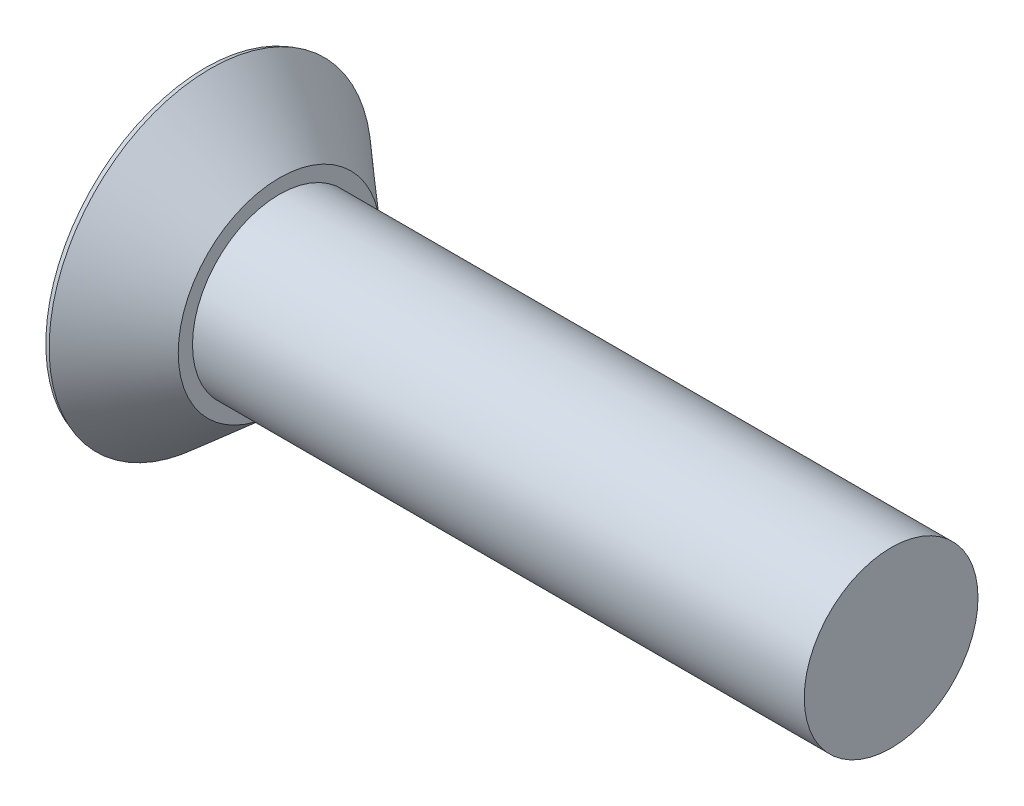
ISO-10303-21;
HEADER;
FILE_DESCRIPTION(('STEP AP214'),'2;1');
FILE_NAME('part.step','',(''),(''),'','','');
FILE_SCHEMA(('AUTOMOTIVE_DESIGN { 1 0 10303 214 1 1 1 1 }'));
ENDSEC;
DATA;
#1=APPLICATION_CONTEXT('core data for automotive mechanical design processes');
#2=APPLICATION_PROTOCOL_DEFINITION('international standard','automotive_design',2000,#1);
#3=PRODUCT_CONTEXT('',#1,'mechanical');
#4=PRODUCT('Part','Part','',(#3));
#5=PRODUCT_RELATED_PRODUCT_CATEGORY('part','',(#4));
#6=PRODUCT_DEFINITION_FORMATION('','',#4);
#7=PRODUCT_DEFINITION_CONTEXT('part definition',#1,'design');
#8=PRODUCT_DEFINITION('design','',#6,#7);
#9=PRODUCT_DEFINITION_SHAPE('','',#8);
#10=(LENGTH_UNIT() NAMED_UNIT(*) SI_UNIT(.MILLI.,.METRE.));
#11=(NAMED_UNIT(*) PLANE_ANGLE_UNIT() SI_UNIT($,.RADIAN.));
#12=(NAMED_UNIT(*) SI_UNIT($,.STERADIAN.) SOLID_ANGLE_UNIT());
#13=UNCERTAINTY_MEASURE_WITH_UNIT(LENGTH_MEASURE(1.E-05),#10,'distance_accuracy_value','');
#14=(GEOMETRIC_REPRESENTATION_CONTEXT(3) GLOBAL_UNCERTAINTY_ASSIGNED_CONTEXT((#13)) GLOBAL_UNIT_ASSIGNED_CONTEXT((#10,
#11,#12)) REPRESENTATION_CONTEXT('',''));
#15=CARTESIAN_POINT('',(0.,0.,0.));
#16=DIRECTION('',(0.,0.,1.));
#17=DIRECTION('',(1.,0.,0.));
#18=AXIS2_PLACEMENT_3D('',#15,#16,#17);
#19=CARTESIAN_POINT('',(-9.525,0.,0.));
#20=DIRECTION('',(1.,0.,0.));
#21=DIRECTION('',(0.,1.,0.));
#22=AXIS2_PLACEMENT_3D('',#19,#20,#21);
#23=PLANE('',#22);
#24=CARTESIAN_POINT('',(-9.525,0.,0.));
#25=DIRECTION('',(1.,0.,0.));
#26=DIRECTION('',(0.,1.,0.));
#27=AXIS2_PLACEMENT_3D('',#24,#25,#26);
#28=CIRCLE('',#27,4.42896480288777);
#29=CARTESIAN_POINT('',(-9.525,4.42896480288777,0.));
#30=VERTEX_POINT('',#29);
#31=EDGE_CURVE('E45',#30,#30,#28,.F.);
#32=ORIENTED_EDGE('',*,*,#31,.T.);
#33=EDGE_LOOP('',(#32));
#34=FACE_BOUND('',#33,.T.);
#35=CARTESIAN_POINT('',(-9.525,0.,0.));
#36=DIRECTION('',(-1.,0.,0.));
#37=DIRECTION('',(0.,-1.,0.));
#38=AXIS2_PLACEMENT_3D('',#35,#36,#37);
#39=CIRCLE('',#38,2.56686175479273);
#40=CARTESIAN_POINT('',(-9.525,0.612986666666666,2.49259435422343));
#41=VERTEX_POINT('',#40);
#42=CARTESIAN_POINT('',(-9.525,-0.612986666666676,2.49259435422343));
#43=VERTEX_POINT('',#42);
#44=EDGE_CURVE('E233',#41,#43,#39,.F.);
#45=ORIENTED_EDGE('',*,*,#44,.T.);
#46=DIRECTION('',(0.,0.,1.));
#47=VECTOR('',#46,1.);
#48=CARTESIAN_POINT('',(-9.525,-0.612986666666678,3.0030091049257));
#49=LINE('',#48,#47);
#50=CARTESIAN_POINT('',(-9.525,-0.612986666666674,1.80799788579618));
#51=VERTEX_POINT('',#50);
#52=EDGE_CURVE('E209',#51,#43,#49,.T.);
#53=ORIENTED_EDGE('',*,*,#52,.F.);
#54=DIRECTION('',(0.,0.382683432365087,0.923879532511288));
#55=VECTOR('',#54,1.);
#56=CARTESIAN_POINT('',(-9.525,-0.612986666666674,1.80799788579618));
#57=LINE('',#56,#55);
#58=CARTESIAN_POINT('',(-9.525,-0.962997349155703,0.962997349155698));
#59=VERTEX_POINT('',#58);
#60=EDGE_CURVE('E205',#59,#51,#57,.T.);
#61=ORIENTED_EDGE('',*,*,#60,.F.);
#62=DIRECTION('',(0.,0.923879532511285,0.382683432365093));
#63=VECTOR('',#62,1.);
#64=CARTESIAN_POINT('',(-9.525,-0.962997349155703,0.962997349155698));
#65=LINE('',#64,#63);
#66=CARTESIAN_POINT('',(-9.525,-1.80799788579619,0.612986666666661));
#67=VERTEX_POINT('',#66);
#68=EDGE_CURVE('E215',#67,#59,#65,.T.);
#69=ORIENTED_EDGE('',*,*,#68,.F.);
#70=DIRECTION('',(0.,1.,0.));
#71=VECTOR('',#70,1.);
#72=CARTESIAN_POINT('',(-9.525,-1.80799788579619,0.612986666666661));
#73=LINE('',#72,#71);
#74=CARTESIAN_POINT('',(-9.525,-2.49259435422343,0.612986666666659));
#75=VERTEX_POINT('',#74);
#76=EDGE_CURVE('E212',#75,#67,#73,.T.);
#77=ORIENTED_EDGE('',*,*,#76,.F.);
#78=CARTESIAN_POINT('',(-9.525,0.,0.));
#79=DIRECTION('',(-1.,0.,0.));
#80=DIRECTION('',(0.,-1.,0.));
#81=AXIS2_PLACEMENT_3D('',#78,#79,#80);
#82=CIRCLE('',#81,2.56686175479273);
#83=CARTESIAN_POINT('',(-9.525,-2.49259435422343,-0.612986666666665));
#84=VERTEX_POINT('',#83);
#85=EDGE_CURVE('E219',#75,#84,#82,.F.);
#86=ORIENTED_EDGE('',*,*,#85,.T.);
#87=DIRECTION('',(0.,-1.,0.));
#88=VECTOR('',#87,1.);
#89=CARTESIAN_POINT('',(-9.525,-3.0030091049257,-0.612986666666665));
#90=LINE('',#89,#88);
#91=CARTESIAN_POINT('',(-9.525,-1.80799788579619,-0.612986666666666));
#92=VERTEX_POINT('',#91);
#93=EDGE_CURVE('E193',#92,#84,#90,.T.);
#94=ORIENTED_EDGE('',*,*,#93,.F.);
#95=DIRECTION('',(0.,-0.923879532511287,0.38268343236509));
#96=VECTOR('',#95,1.);
#97=CARTESIAN_POINT('',(-9.525,-1.80799788579619,-0.612986666666666));
#98=LINE('',#97,#96);
#99=CARTESIAN_POINT('',(-9.525,-0.962997349155703,-0.962997349155697));
#100=VERTEX_POINT('',#99);
#101=EDGE_CURVE('E190',#100,#92,#98,.T.);
#102=ORIENTED_EDGE('',*,*,#101,.F.);
#103=DIRECTION('',(0.,-0.38268343236509,0.923879532511287));
#104=VECTOR('',#103,1.);
#105=CARTESIAN_POINT('',(-9.525,-0.962997349155703,-0.962997349155697));
#106=LINE('',#105,#104);
#107=CARTESIAN_POINT('',(-9.525,-0.612986666666669,-1.80799788579618));
#108=VERTEX_POINT('',#107);
#109=EDGE_CURVE('E200',#108,#100,#106,.T.);
#110=ORIENTED_EDGE('',*,*,#109,.F.);
#111=DIRECTION('',(0.,0.,1.));
#112=VECTOR('',#111,1.);
#113=CARTESIAN_POINT('',(-9.525,-0.612986666666669,-1.80799788579618));
#114=LINE('',#113,#112);
#115=CARTESIAN_POINT('',(-9.525,-0.612986666666669,-2.49259435422343));
#116=VERTEX_POINT('',#115);
#117=EDGE_CURVE('E197',#116,#108,#114,.T.);
#118=ORIENTED_EDGE('',*,*,#117,.F.);
#119=CARTESIAN_POINT('',(-9.525,0.,0.));
#120=DIRECTION('',(-1.,0.,0.));
#121=DIRECTION('',(0.,-1.,0.));
#122=AXIS2_PLACEMENT_3D('',#119,#120,#121);
#123=CIRCLE('',#122,2.56686175479273);
#124=CARTESIAN_POINT('',(-9.525,0.61298666666669,-2.49259435422342));
#125=VERTEX_POINT('',#124);
#126=EDGE_CURVE('E183',#116,#125,#123,.F.);
#127=ORIENTED_EDGE('',*,*,#126,.T.);
#128=DIRECTION('',(0.,0.,-1.));
#129=VECTOR('',#128,1.);
#130=CARTESIAN_POINT('',(-9.525,0.612986666666695,-3.0030091049257));
#131=LINE('',#130,#129);
#132=CARTESIAN_POINT('',(-9.525,0.612986666666683,-1.80799788579618));
#133=VERTEX_POINT('',#132);
#134=EDGE_CURVE('E164',#133,#125,#131,.T.);
#135=ORIENTED_EDGE('',*,*,#134,.F.);
#136=DIRECTION('',(0.,-0.38268343236508,-0.923879532511291));
#137=VECTOR('',#136,1.);
#138=CARTESIAN_POINT('',(-9.525,0.612986666666683,-1.80799788579618));
#139=LINE('',#138,#137);
#140=CARTESIAN_POINT('',(-9.525,0.962997349155706,-0.962997349155691));
#141=VERTEX_POINT('',#140);
#142=EDGE_CURVE('E173',#141,#133,#139,.T.);
#143=ORIENTED_EDGE('',*,*,#142,.F.);
#144=DIRECTION('',(0.,-0.923879532511283,-0.3826834323651));
#145=VECTOR('',#144,1.);
#146=CARTESIAN_POINT('',(-9.525,0.962997349155706,-0.962997349155691));
#147=LINE('',#146,#145);
#148=CARTESIAN_POINT('',(-9.525,1.80799788579619,-0.612986666666649));
#149=VERTEX_POINT('',#148);
#150=EDGE_CURVE('E170',#149,#141,#147,.T.);
#151=ORIENTED_EDGE('',*,*,#150,.F.);
#152=DIRECTION('',(0.,-1.,0.));
#153=VECTOR('',#152,1.);
#154=CARTESIAN_POINT('',(-9.525,1.80799788579619,-0.612986666666649));
#155=LINE('',#154,#153);
#156=CARTESIAN_POINT('',(-9.525,2.49259435422343,-0.612986666666642));
#157=VERTEX_POINT('',#156);
#158=EDGE_CURVE('E184',#157,#149,#155,.T.);
#159=ORIENTED_EDGE('',*,*,#158,.F.);
#160=CARTESIAN_POINT('',(-9.525,2.49259435422343,0.612986666666665));
#161=VERTEX_POINT('',#160);
#162=EDGE_CURVE('E236',#157,#161,#39,.F.);
#163=ORIENTED_EDGE('',*,*,#162,.T.);
#164=DIRECTION('',(0.,1.,0.));
#165=VECTOR('',#164,1.);
#166=CARTESIAN_POINT('',(-9.525,3.0030091049257,0.612986666666665));
#167=LINE('',#166,#165);
#168=CARTESIAN_POINT('',(-9.525,1.80799788579618,0.612986666666666));
#169=VERTEX_POINT('',#168);
#170=EDGE_CURVE('E53',#169,#161,#167,.T.);
#171=ORIENTED_EDGE('',*,*,#170,.F.);
#172=DIRECTION('',(0.,0.923879532511287,-0.38268343236509));
#173=VECTOR('',#172,1.);
#174=CARTESIAN_POINT('',(-9.525,1.80799788579618,0.612986666666666));
#175=LINE('',#174,#173);
#176=CARTESIAN_POINT('',(-9.525,0.962997349155699,0.962997349155697));
#177=VERTEX_POINT('',#176);
#178=EDGE_CURVE('E222',#177,#169,#175,.T.);
#179=ORIENTED_EDGE('',*,*,#178,.F.);
#180=DIRECTION('',(0.,0.38268343236509,-0.923879532511287));
#181=VECTOR('',#180,1.);
#182=CARTESIAN_POINT('',(-9.525,0.962997349155699,0.962997349155697));
#183=LINE('',#182,#181);
#184=CARTESIAN_POINT('',(-9.525,0.612986666666666,1.80799788579618));
#185=VERTEX_POINT('',#184);
#186=EDGE_CURVE('E229',#185,#177,#183,.T.);
#187=ORIENTED_EDGE('',*,*,#186,.F.);
#188=DIRECTION('',(0.,0.,-1.));
#189=VECTOR('',#188,1.);
#190=CARTESIAN_POINT('',(-9.525,0.612986666666666,1.80799788579618));
#191=LINE('',#190,#189);
#192=EDGE_CURVE('E227',#41,#185,#191,.T.);
#193=ORIENTED_EDGE('',*,*,#192,.F.);
#194=EDGE_LOOP('',(#45,#53,#61,#69,#77,#86,#94,#102,#110,#118,#127,#135,#143,#151,#159,#163,
#171,#179,#187,#193));
#195=FACE_BOUND('',#194,.T.);
#196=ADVANCED_FACE('F36',(#34,#195),#23,.F.);
#197=CARTESIAN_POINT('',(9.525,0.,0.));
#198=DIRECTION('',(-1.,0.,0.));
#199=DIRECTION('',(0.,-1.,0.));
#200=AXIS2_PLACEMENT_3D('',#197,#198,#199);
#201=PLANE('',#200);
#202=CARTESIAN_POINT('',(9.525,0.,0.));
#203=DIRECTION('',(-1.,0.,0.));
#204=DIRECTION('',(0.,-1.,0.));
#205=AXIS2_PLACEMENT_3D('',#202,#203,#204);
#206=CIRCLE('',#205,2.413);
#207=CARTESIAN_POINT('',(9.525,-2.41299999999999,0.));
#208=VERTEX_POINT('',#207);
#209=EDGE_CURVE('E242',#208,#208,#206,.T.);
#210=ORIENTED_EDGE('',*,*,#209,.F.);
#211=EDGE_LOOP('',(#210));
#212=FACE_BOUND('',#211,.T.);
#213=ADVANCED_FACE('F394',(#212),#201,.F.);
#214=CARTESIAN_POINT('',(-9.525,0.,0.));
#215=DIRECTION('',(-1.,0.,0.));
#216=DIRECTION('',(0.,-1.,0.));
#217=AXIS2_PLACEMENT_3D('',#214,#215,#216);
#218=CYLINDRICAL_SURFACE('',#217,2.413);
#219=CARTESIAN_POINT('',(-7.4676,0.,0.));
#220=DIRECTION('',(-1.,0.,0.));
#221=DIRECTION('',(0.,-1.,0.));
#222=AXIS2_PLACEMENT_3D('',#219,#220,#221);
#223=CIRCLE('',#222,2.413);
#224=CARTESIAN_POINT('',(-7.4676,-2.413,0.));
#225=VERTEX_POINT('',#224);
#226=EDGE_CURVE('E239',#225,#225,#223,.T.);
#227=ORIENTED_EDGE('',*,*,#226,.F.);
#228=EDGE_LOOP('',(#227));
#229=FACE_BOUND('',#228,.T.);
#230=ORIENTED_EDGE('',*,*,#209,.T.);
#231=EDGE_LOOP('',(#230));
#232=FACE_BOUND('',#231,.T.);
#233=ADVANCED_FACE('F399',(#229,#232),#218,.T.);
#234=CARTESIAN_POINT('',(-7.4676,2.413,0.));
#235=DIRECTION('',(-1.,0.,0.));
#236=DIRECTION('',(0.,-1.,0.));
#237=AXIS2_PLACEMENT_3D('',#234,#235,#236);
#238=PLANE('',#237);
#239=CARTESIAN_POINT('',(-7.4676,0.,0.));
#240=DIRECTION('',(-1.,0.,0.));
#241=DIRECTION('',(0.,-1.,0.));
#242=AXIS2_PLACEMENT_3D('',#239,#240,#241);
#243=CIRCLE('',#242,2.80892946561688);
#244=CARTESIAN_POINT('',(-7.4676,-2.80892946561688,0.));
#245=VERTEX_POINT('',#244);
#246=EDGE_CURVE('E235',#245,#245,#243,.T.);
#247=ORIENTED_EDGE('',*,*,#246,.F.);
#248=EDGE_LOOP('',(#247));
#249=FACE_BOUND('',#248,.T.);
#250=ORIENTED_EDGE('',*,*,#226,.T.);
#251=EDGE_LOOP('',(#250));
#252=FACE_BOUND('',#251,.T.);
#253=ADVANCED_FACE('F405',(#249,#252),#238,.F.);
#254=CARTESIAN_POINT('',(-7.4676,0.,0.));
#255=DIRECTION('',(-1.,0.,0.));
#256=DIRECTION('',(0.,-1.,0.));
#257=AXIS2_PLACEMENT_3D('',#254,#255,#256);
#258=CONICAL_SURFACE('',#257,2.80892946561688,0.715584993317677);
#259=CARTESIAN_POINT('',(-9.38621192703535,0.,0.));
#260=DIRECTION('',(1.,0.,0.));
#261=DIRECTION('',(0.,1.,0.));
#262=AXIS2_PLACEMENT_3D('',#259,#260,#261);
#263=CIRCLE('',#262,4.47675336880476);
#264=CARTESIAN_POINT('',(-9.38621192703535,4.47675336880476,0.));
#265=VERTEX_POINT('',#264);
#266=EDGE_CURVE('E12',#265,#265,#263,.T.);
#267=ORIENTED_EDGE('',*,*,#266,.T.);
#268=EDGE_LOOP('',(#267));
#269=FACE_BOUND('',#268,.T.);
#270=ORIENTED_EDGE('',*,*,#246,.T.);
#271=EDGE_LOOP('',(#270));
#272=FACE_BOUND('',#271,.T.);
#273=ADVANCED_FACE('F270',(#269,#272),#258,.T.);
#274=CARTESIAN_POINT('',(-9.525,3.0030091049257,0.612986666666665));
#275=DIRECTION('',(-0.0871557427476584,0.,-0.996194698091746));
#276=DIRECTION('',(-0.996194698091746,0.,0.0871557427476584));
#277=AXIS2_PLACEMENT_3D('',#274,#275,#276);
#278=PLANE('',#277);
#279=CARTESIAN_POINT('',(-9.525,2.49259435422343,0.612986666666665));
#280=CARTESIAN_POINT('',(-9.45852625718821,2.43451712174877,0.607170967748496));
#281=CARTESIAN_POINT('',(-9.39207159555621,2.37641786243142,0.601356938217244));
#282=CARTESIAN_POINT('',(-9.25921246540809,2.26016171559922,0.589733270483369));
#283=CARTESIAN_POINT('',(-9.19280799682935,2.20200482815647,0.583923632275266));
#284=CARTESIAN_POINT('',(-9.06006108173407,2.08561967425411,0.572309782086391));
#285=CARTESIAN_POINT('',(-8.99371863525081,2.02739140775625,0.56650557010853));
#286=CARTESIAN_POINT('',(-8.86111534464012,1.91084116370602,0.554904285433861));
#287=CARTESIAN_POINT('',(-8.7948545006156,1.85251918603572,0.549107212746055));
#288=CARTESIAN_POINT('',(-8.72864431374507,1.79413924450273,0.543314571984952));
#289=B_SPLINE_CURVE_WITH_KNOTS('',3,(#279,#280,#281,#282,#283,#284,#285,#286,#287,#288),
.UNSPECIFIED.,.F.,.F.,(4,2,2,2,4),(0.,0.265386357789265,0.530772383889083,0.796158552282147,
1.06154505496734),.UNSPECIFIED.);
#290=CARTESIAN_POINT('',(-8.72864431374506,1.79413924450274,0.54331457198495));
#291=VERTEX_POINT('',#290);
#292=EDGE_CURVE('E103',#161,#291,#289,.T.);
#293=ORIENTED_EDGE('',*,*,#292,.T.);
#294=DIRECTION('',(-0.996045029063886,0.0173337504938601,0.0871426484044397));
#295=VECTOR('',#294,1.);
#296=CARTESIAN_POINT('',(-9.54563210293773,1.80835693755996,0.614791741778417));
#297=LINE('',#296,#295);
#298=EDGE_CURVE('E232',#291,#169,#297,.T.);
#299=ORIENTED_EDGE('',*,*,#298,.T.);
#300=ORIENTED_EDGE('',*,*,#170,.T.);
#301=EDGE_LOOP('',(#293,#299,#300));
#302=FACE_BOUND('',#301,.T.);
#303=ADVANCED_FACE('F412',(#302),#278,.T.);
#304=CARTESIAN_POINT('',(-9.525,0.612986666666666,1.80799788579618));
#305=DIRECTION('',(-0.0871557427476582,-0.996194698091746,0.));
#306=DIRECTION('',(0.996194698091746,-0.0871557427476582,0.));
#307=AXIS2_PLACEMENT_3D('',#304,#305,#306);
#308=PLANE('',#307);
#309=CARTESIAN_POINT('',(-8.72864431374506,0.543314571984951,1.79413924450274));
#310=CARTESIAN_POINT('',(-8.79485450061559,0.549107212746055,1.85251918603572));
#311=CARTESIAN_POINT('',(-8.86111534464012,0.554904285433861,1.91084116370602));
#312=CARTESIAN_POINT('',(-8.99371863525081,0.56650557010853,2.02739140775624));
#313=CARTESIAN_POINT('',(-9.06006108173407,0.572309782086391,2.08561967425411));
#314=CARTESIAN_POINT('',(-9.19280799682935,0.583923632275266,2.20200482815647));
#315=CARTESIAN_POINT('',(-9.25921246540809,0.589733270483369,2.26016171559922));
#316=CARTESIAN_POINT('',(-9.3920715955562,0.601356938217245,2.37641786243142));
#317=CARTESIAN_POINT('',(-9.45852625718821,0.607170967748497,2.43451712174877));
#318=CARTESIAN_POINT('',(-9.525,0.612986666666666,2.49259435422343));
#319=B_SPLINE_CURVE_WITH_KNOTS('',3,(#309,#310,#311,#312,#313,#314,#315,#316,#317,#318),
.UNSPECIFIED.,.F.,.F.,(4,2,2,2,4),(0.,0.265386502685197,0.530772671078261,0.796158697178077,
1.06154505496734),.UNSPECIFIED.);
#320=CARTESIAN_POINT('',(-8.72864431374506,0.543314571984951,1.79413924450274));
#321=VERTEX_POINT('',#320);
#322=EDGE_CURVE('E110',#321,#41,#319,.T.);
#323=ORIENTED_EDGE('',*,*,#322,.T.);
#324=ORIENTED_EDGE('',*,*,#192,.T.);
#325=DIRECTION('',(-0.996045029063886,0.0871426484044395,0.0173337504938603));
#326=VECTOR('',#325,1.);
#327=CARTESIAN_POINT('',(-9.54079112793824,0.61436821134555,1.8082726921189));
#328=LINE('',#327,#326);
#329=EDGE_CURVE('E491',#321,#185,#328,.T.);
#330=ORIENTED_EDGE('',*,*,#329,.F.);
#331=EDGE_LOOP('',(#323,#324,#330));
#332=FACE_BOUND('',#331,.T.);
#333=ADVANCED_FACE('F386',(#332),#308,.T.);
#334=CARTESIAN_POINT('',(-9.525,0.962997349155699,0.962997349155697));
#335=DIRECTION('',(-0.0871557427476582,-0.920363891963224,-0.381227206369654));
#336=DIRECTION('',(0.,0.38268343236509,-0.923879532511287));
#337=AXIS2_PLACEMENT_3D('',#334,#335,#336);
#338=PLANE('',#337);
#339=CARTESIAN_POINT('',(-7.96936627882286,0.858830677621024,0.858830677621022));
#340=CARTESIAN_POINT('',(-7.98773008078839,0.845861311740582,0.894339808742347));
#341=CARTESIAN_POINT('',(-8.00751073815191,0.833290385156989,0.929210942225205));
#342=CARTESIAN_POINT('',(-8.04929523569009,0.808844137216208,0.997782131217437));
#343=CARTESIAN_POINT('',(-8.07129592703071,0.796967867344013,1.03148375676164));
#344=CARTESIAN_POINT('',(-8.11688394623063,0.773814996497049,1.09780201415296));
#345=CARTESIAN_POINT('',(-8.14046539553529,0.762536425620263,1.13042205781558));
#346=CARTESIAN_POINT('',(-8.18892091570705,0.740432754908314,1.19486288691552));
#347=CARTESIAN_POINT('',(-8.21379549823537,0.72960783768,1.22668334847634));
#348=CARTESIAN_POINT('',(-8.2896099953659,0.697817552188115,1.32076451343813));
#349=CARTESIAN_POINT('',(-8.3420138614753,0.677403712753784,1.38202839543574));
#350=CARTESIAN_POINT('',(-8.44933961567024,0.637580711010604,1.50270632169112));
#351=CARTESIAN_POINT('',(-8.50426350574405,0.618172374507332,1.56211882997023));
#352=CARTESIAN_POINT('',(-8.58774054968342,0.589669195208701,1.6500160215653));
#353=CARTESIAN_POINT('',(-8.61565663760378,0.580298841705688,1.6790202012557));
#354=CARTESIAN_POINT('',(-8.67188075716315,0.561701795703918,1.73677133803157));
#355=CARTESIAN_POINT('',(-8.70018925604009,0.552475308378392,1.76551790660447));
#356=CARTESIAN_POINT('',(-8.72864431374507,0.543314571984955,1.79413924450274));
#357=B_SPLINE_CURVE_WITH_KNOTS('',3,(#339,#340,#341,#342,#343,#344,#345,#346,#347,#348,#349,
#350,#351,#352,#353,#354,#355,#356),.UNSPECIFIED.,.F.,.F.,(4,2,2,2,2,2,2,2,4),(0.,
0.125991063230867,0.251805871235963,0.377176294454523,0.502596706949742,0.751972793926603,
1.00155054476538,1.12554483820984,1.24970222508254),.UNSPECIFIED.);
#358=CARTESIAN_POINT('',(-7.96936627882286,0.858830677621024,0.858830677621022));
#359=VERTEX_POINT('',#358);
#360=EDGE_CURVE('E373',#359,#321,#357,.T.);
#361=ORIENTED_EDGE('',*,*,#360,.T.);
#362=ORIENTED_EDGE('',*,*,#329,.T.);
#363=ORIENTED_EDGE('',*,*,#186,.T.);
#364=DIRECTION('',(-0.995546167269401,0.0666626913468322,0.0666626913468324));
#365=VECTOR('',#364,1.);
#366=CARTESIAN_POINT('',(-9.55785039116353,0.96519704170513,0.965197041705128));
#367=LINE('',#366,#365);
#368=EDGE_CURVE('E492',#359,#177,#367,.T.);
#369=ORIENTED_EDGE('',*,*,#368,.F.);
#370=EDGE_LOOP('',(#361,#362,#363,#369));
#371=FACE_BOUND('',#370,.T.);
#372=ADVANCED_FACE('F383',(#371),#338,.T.);
#373=CARTESIAN_POINT('',(-9.525,1.80799788579618,0.612986666666666));
#374=DIRECTION('',(-0.0871557427476583,-0.381227206369654,-0.920363891963224));
#375=DIRECTION('',(0.,0.923879532511287,-0.38268343236509));
#376=AXIS2_PLACEMENT_3D('',#373,#374,#375);
#377=PLANE('',#376);
#378=CARTESIAN_POINT('',(-8.72864431374506,1.79413924450274,0.54331457198495));
#379=CARTESIAN_POINT('',(-8.6928237231468,1.75810862754568,0.554846838037268));
#380=CARTESIAN_POINT('',(-8.65723649577501,1.72188224176137,0.566482293001348));
#381=CARTESIAN_POINT('',(-8.58665424443517,1.64894213550245,0.59001114348121));
#382=CARTESIAN_POINT('',(-8.55165920532459,1.61222842753187,0.601904532383704));
#383=CARTESIAN_POINT('',(-8.44808495847438,1.50157003185814,0.637932565338746));
#384=CARTESIAN_POINT('',(-8.38056559969842,1.4267592524772,0.662526320877639));
#385=CARTESIAN_POINT('',(-8.28277756568872,1.31178739021939,0.700888987462048));
#386=CARTESIAN_POINT('',(-8.2507060200217,1.27292798292597,0.713948000320908));
#387=CARTESIAN_POINT('',(-8.18823184537844,1.19412613928344,0.740672672844265));
#388=CARTESIAN_POINT('',(-8.15782823814341,1.15418435874481,0.754337968224948));
#389=CARTESIAN_POINT('',(-8.09910671946202,1.07273267855995,0.782515604420261));
#390=CARTESIAN_POINT('',(-8.07079969287983,1.03121608627811,0.797031748179821));
#391=CARTESIAN_POINT('',(-8.01739578555224,0.946411001554988,0.82710197210738));
#392=CARTESIAN_POINT('',(-7.99230571700901,0.903118997109708,0.842658152090496));
#393=CARTESIAN_POINT('',(-7.96936627882206,0.858830677621697,0.858830677620669));
#394=B_SPLINE_CURVE_WITH_KNOTS('',3,(#378,#379,#380,#381,#382,#383,#384,#385,#386,#387,#388,
#389,#390,#391,#392,#393),.UNSPECIFIED.,.F.,.F.,(4,2,2,2,2,2,2,4),(0.,0.156290436692992,
0.312576870908878,0.623628612554109,0.779746534885239,0.93577189181782,1.09255751450351,
1.24966984635691),.UNSPECIFIED.);
#395=EDGE_CURVE('E100',#291,#359,#394,.T.);
#396=ORIENTED_EDGE('',*,*,#395,.T.);
#397=ORIENTED_EDGE('',*,*,#368,.T.);
#398=ORIENTED_EDGE('',*,*,#178,.T.);
#399=ORIENTED_EDGE('',*,*,#298,.F.);
#400=EDGE_LOOP('',(#396,#397,#398,#399));
#401=FACE_BOUND('',#400,.T.);
#402=ADVANCED_FACE('F268',(#401),#377,.T.);
#403=CARTESIAN_POINT('',(-8.47298859329365,0.,0.));
#404=DIRECTION('',(-1.,0.,0.));
#405=DIRECTION('',(0.,-1.,0.));
#406=AXIS2_PLACEMENT_3D('',#403,#404,#405);
#407=CONICAL_SURFACE('',#406,1.6523621909115,0.715584993317677);
#408=CARTESIAN_POINT('',(-6.57216333158257,0.,0.));
#409=VERTEX_POINT('',#408);
#410=VERTEX_LOOP('',#409);
#411=FACE_BOUND('',#410,.T.);
#412=ORIENTED_EDGE('',*,*,#162,.F.);
#413=CARTESIAN_POINT('',(-8.72864431374506,1.79413924450275,-0.543314571984934));
#414=CARTESIAN_POINT('',(-8.79485450061559,1.85251918603573,-0.549107212746037));
#415=CARTESIAN_POINT('',(-8.86111534464012,1.91084116370603,-0.554904285433843));
#416=CARTESIAN_POINT('',(-8.99371863525081,2.02739140775625,-0.56650557010851));
#417=CARTESIAN_POINT('',(-9.06006108173407,2.08561967425412,-0.572309782086371));
#418=CARTESIAN_POINT('',(-9.19280799682935,2.20200482815648,-0.583923632275245));
#419=CARTESIAN_POINT('',(-9.25921246540809,2.26016171559922,-0.589733270483347));
#420=CARTESIAN_POINT('',(-9.3920715955562,2.37641786243143,-0.601356938217221));
#421=CARTESIAN_POINT('',(-9.45852625718821,2.43451712174877,-0.607170967748473));
#422=CARTESIAN_POINT('',(-9.525,2.49259435422343,-0.612986666666642));
#423=B_SPLINE_CURVE_WITH_KNOTS('',3,(#413,#414,#415,#416,#417,#418,#419,#420,#421,#422),
.UNSPECIFIED.,.F.,.F.,(4,2,2,2,4),(0.,0.265386502685195,0.530772671078261,0.796158697178079,
1.06154505496735),.UNSPECIFIED.);
#424=CARTESIAN_POINT('',(-8.72864431374506,1.79413924450275,-0.543314571984934));
#425=VERTEX_POINT('',#424);
#426=EDGE_CURVE('E254',#425,#157,#423,.T.);
#427=ORIENTED_EDGE('',*,*,#426,.F.);
#428=CARTESIAN_POINT('',(-7.96936627882286,0.85883067762103,-0.858830677621017));
#429=CARTESIAN_POINT('',(-7.98773008078839,0.894339808742354,-0.845861311740574));
#430=CARTESIAN_POINT('',(-8.00751073815191,0.929210942225213,-0.833290385156981));
#431=CARTESIAN_POINT('',(-8.04929523569009,0.997782131217444,-0.808844137216199));
#432=CARTESIAN_POINT('',(-8.07129592703071,1.03148375676165,-0.796967867344003));
#433=CARTESIAN_POINT('',(-8.11688394623063,1.09780201415297,-0.773814996497039));
#434=CARTESIAN_POINT('',(-8.14046539553529,1.13042205781558,-0.762536425620252));
#435=CARTESIAN_POINT('',(-8.18892091570705,1.19486288691553,-0.740432754908303));
#436=CARTESIAN_POINT('',(-8.21379549823537,1.22668334847635,-0.729607837679989));
#437=CARTESIAN_POINT('',(-8.2896099953659,1.32076451343814,-0.697817552188103));
#438=CARTESIAN_POINT('',(-8.3420138614753,1.38202839543574,-0.677403712753771));
#439=CARTESIAN_POINT('',(-8.44933961567024,1.50270632169113,-0.63758071101059));
#440=CARTESIAN_POINT('',(-8.50426350574405,1.56211882997023,-0.618172374507317));
#441=CARTESIAN_POINT('',(-8.58774054968342,1.6500160215653,-0.589669195208686));
#442=CARTESIAN_POINT('',(-8.61565663760378,1.6790202012557,-0.580298841705673));
#443=CARTESIAN_POINT('',(-8.67188075716315,1.73677133803157,-0.561701795703902));
#444=CARTESIAN_POINT('',(-8.70018925604009,1.76551790660448,-0.552475308378375));
#445=CARTESIAN_POINT('',(-8.72864431374507,1.79413924450274,-0.543314571984937));
#446=B_SPLINE_CURVE_WITH_KNOTS('',3,(#428,#429,#430,#431,#432,#433,#434,#435,#436,#437,#438,
#439,#440,#441,#442,#443,#444,#445),.UNSPECIFIED.,.F.,.F.,(4,2,2,2,2,2,2,2,4),(0.,
0.125991063230867,0.251805871235963,0.377176294454523,0.502596706949742,0.751972793926601,
1.00155054476538,1.12554483820983,1.24970222508254),.UNSPECIFIED.);
#447=CARTESIAN_POINT('',(-7.96936627882286,0.85883067762103,-0.858830677621017));
#448=VERTEX_POINT('',#447);
#449=EDGE_CURVE('E287',#448,#425,#446,.T.);
#450=ORIENTED_EDGE('',*,*,#449,.F.);
#451=CARTESIAN_POINT('',(-8.72864431374506,0.543314571984968,-1.79413924450274));
#452=CARTESIAN_POINT('',(-8.6928237231468,0.554846838037285,-1.75810862754567));
#453=CARTESIAN_POINT('',(-8.65723649577501,0.566482293001365,-1.72188224176136));
#454=CARTESIAN_POINT('',(-8.58665424443517,0.590011143481226,-1.64894213550245));
#455=CARTESIAN_POINT('',(-8.55165920532459,0.601904532383719,-1.61222842753186));
#456=CARTESIAN_POINT('',(-8.44808495847438,0.637932565338761,-1.50157003185814));
#457=CARTESIAN_POINT('',(-8.38056559969842,0.662526320877653,-1.4267592524772));
#458=CARTESIAN_POINT('',(-8.28277756568872,0.70088898746206,-1.31178739021938));
#459=CARTESIAN_POINT('',(-8.2507060200217,0.713948000320919,-1.27292798292596));
#460=CARTESIAN_POINT('',(-8.18823184537844,0.740672672844276,-1.19412613928343));
#461=CARTESIAN_POINT('',(-8.15782823814341,0.754337968224959,-1.15418435874481));
#462=CARTESIAN_POINT('',(-8.09910671946203,0.78251560442027,-1.07273267855995));
#463=CARTESIAN_POINT('',(-8.07079969287983,0.79703174817983,-1.0312160862781));
#464=CARTESIAN_POINT('',(-8.01739578555224,0.827101972107388,-0.946411001554981));
#465=CARTESIAN_POINT('',(-7.99230571700901,0.842658152090505,-0.9031189971097));
#466=CARTESIAN_POINT('',(-7.96936627882206,0.858830677620676,-0.85883067762169));
#467=B_SPLINE_CURVE_WITH_KNOTS('',3,(#451,#452,#453,#454,#455,#456,#457,#458,#459,#460,#461,
#462,#463,#464,#465,#466),.UNSPECIFIED.,.F.,.F.,(4,2,2,2,2,2,2,4),(0.,0.156290436692993,
0.312576870908879,0.623628612554109,0.77974653488524,0.935771891817819,1.09255751450351,
1.24966984635691),.UNSPECIFIED.);
#468=CARTESIAN_POINT('',(-8.72864431374506,0.543314571984968,-1.79413924450274));
#469=VERTEX_POINT('',#468);
#470=EDGE_CURVE('E194',#469,#448,#467,.T.);
#471=ORIENTED_EDGE('',*,*,#470,.F.);
#472=CARTESIAN_POINT('',(-9.525,0.61298666666669,-2.49259435422342));
#473=CARTESIAN_POINT('',(-9.45852625718821,0.60717096774852,-2.43451712174876));
#474=CARTESIAN_POINT('',(-9.39207159555621,0.601356938217267,-2.37641786243142));
#475=CARTESIAN_POINT('',(-9.25921246540809,0.589733270483391,-2.26016171559921));
#476=CARTESIAN_POINT('',(-9.19280799682935,0.583923632275287,-2.20200482815647));
#477=CARTESIAN_POINT('',(-9.06006108173407,0.572309782086411,-2.08561967425411));
#478=CARTESIAN_POINT('',(-8.99371863525081,0.566505570108549,-2.02739140775624));
#479=CARTESIAN_POINT('',(-8.86111534464012,0.554904285433879,-1.91084116370602));
#480=CARTESIAN_POINT('',(-8.79485450061559,0.549107212746073,-1.85251918603571));
#481=CARTESIAN_POINT('',(-8.72864431374507,0.543314571984969,-1.79413924450272));
#482=B_SPLINE_CURVE_WITH_KNOTS('',3,(#472,#473,#474,#475,#476,#477,#478,#479,#480,#481),
.UNSPECIFIED.,.F.,.F.,(4,2,2,2,4),(0.,0.265386357789266,0.530772383889085,0.796158552282149,
1.06154505496735),.UNSPECIFIED.);
#483=EDGE_CURVE('E166',#125,#469,#482,.T.);
#484=ORIENTED_EDGE('',*,*,#483,.F.);
#485=ORIENTED_EDGE('',*,*,#126,.F.);
#486=CARTESIAN_POINT('',(-8.72864431374506,-0.543314571984954,-1.79413924450274));
#487=CARTESIAN_POINT('',(-8.79485450061559,-0.549107212746059,-1.85251918603572));
#488=CARTESIAN_POINT('',(-8.86111534464012,-0.554904285433864,-1.91084116370602));
#489=CARTESIAN_POINT('',(-8.99371863525081,-0.566505570108534,-2.02739140775624));
#490=CARTESIAN_POINT('',(-9.06006108173407,-0.572309782086395,-2.08561967425411));
#491=CARTESIAN_POINT('',(-9.19280799682935,-0.58392363227527,-2.20200482815647));
#492=CARTESIAN_POINT('',(-9.25921246540809,-0.589733270483373,-2.26016171559922));
#493=CARTESIAN_POINT('',(-9.3920715955562,-0.601356938217248,-2.37641786243142));
#494=CARTESIAN_POINT('',(-9.45852625718821,-0.6071709677485,-2.43451712174876));
#495=CARTESIAN_POINT('',(-9.525,-0.612986666666669,-2.49259435422343));
#496=B_SPLINE_CURVE_WITH_KNOTS('',3,(#486,#487,#488,#489,#490,#491,#492,#493,#494,#495),
.UNSPECIFIED.,.F.,.F.,(4,2,2,2,4),(0.,0.265386502685195,0.530772671078259,0.796158697178075,
1.06154505496734),.UNSPECIFIED.);
#497=CARTESIAN_POINT('',(-8.72864431374506,-0.543314571984954,-1.79413924450274));
#498=VERTEX_POINT('',#497);
#499=EDGE_CURVE('E312',#498,#116,#496,.T.);
#500=ORIENTED_EDGE('',*,*,#499,.F.);
#501=CARTESIAN_POINT('',(-7.96936627882286,-0.858830677621028,-0.858830677621022));
#502=CARTESIAN_POINT('',(-7.98773008078839,-0.845861311740585,-0.894339808742347));
#503=CARTESIAN_POINT('',(-8.00751073815191,-0.833290385156992,-0.929210942225206));
#504=CARTESIAN_POINT('',(-8.0492952356901,-0.808844137216211,-0.997782131217436));
#505=CARTESIAN_POINT('',(-8.07129592703071,-0.796967867344016,-1.03148375676164));
#506=CARTESIAN_POINT('',(-8.11688394623064,-0.773814996497052,-1.09780201415296));
#507=CARTESIAN_POINT('',(-8.14046539553529,-0.762536425620266,-1.13042205781558));
#508=CARTESIAN_POINT('',(-8.18892091570705,-0.740432754908317,-1.19486288691552));
#509=CARTESIAN_POINT('',(-8.21379549823537,-0.729607837680003,-1.22668334847634));
#510=CARTESIAN_POINT('',(-8.2896099953659,-0.697817552188119,-1.32076451343813));
#511=CARTESIAN_POINT('',(-8.3420138614753,-0.677403712753787,-1.38202839543574));
#512=CARTESIAN_POINT('',(-8.44933961567024,-0.637580711010608,-1.50270632169112));
#513=CARTESIAN_POINT('',(-8.50426350574405,-0.618172374507335,-1.56211882997023));
#514=CARTESIAN_POINT('',(-8.58774054968342,-0.589669195208704,-1.6500160215653));
#515=CARTESIAN_POINT('',(-8.61565663760378,-0.580298841705692,-1.67902020125569));
#516=CARTESIAN_POINT('',(-8.67188075716315,-0.561701795703921,-1.73677133803157));
#517=CARTESIAN_POINT('',(-8.70018925604009,-0.552475308378395,-1.76551790660447));
#518=CARTESIAN_POINT('',(-8.72864431374507,-0.543314571984957,-1.79413924450274));
#519=B_SPLINE_CURVE_WITH_KNOTS('',3,(#501,#502,#503,#504,#505,#506,#507,#508,#509,#510,#511,
#512,#513,#514,#515,#516,#517,#518),.UNSPECIFIED.,.F.,.F.,(4,2,2,2,2,2,2,2,4),(0.,
0.125991063230867,0.251805871235963,0.377176294454523,0.502596706949741,0.751972793926601,
1.00155054476538,1.12554483820984,1.24970222508254),.UNSPECIFIED.);
#520=CARTESIAN_POINT('',(-7.96936627882286,-0.858830677621028,-0.858830677621022));
#521=VERTEX_POINT('',#520);
#522=EDGE_CURVE('E320',#521,#498,#519,.T.);
#523=ORIENTED_EDGE('',*,*,#522,.F.);
#524=CARTESIAN_POINT('',(-8.72864431374506,-1.79413924450275,-0.543314571984951));
#525=CARTESIAN_POINT('',(-8.6928237231468,-1.75810862754568,-0.554846838037268));
#526=CARTESIAN_POINT('',(-8.65723649577501,-1.72188224176137,-0.566482293001348));
#527=CARTESIAN_POINT('',(-8.58665424443517,-1.64894213550245,-0.590011143481211));
#528=CARTESIAN_POINT('',(-8.55165920532459,-1.61222842753187,-0.601904532383704));
#529=CARTESIAN_POINT('',(-8.44808495847438,-1.50157003185815,-0.637932565338747));
#530=CARTESIAN_POINT('',(-8.38056559969843,-1.42675925247721,-0.662526320877639));
#531=CARTESIAN_POINT('',(-8.28277756568873,-1.31178739021939,-0.700888987462048));
#532=CARTESIAN_POINT('',(-8.25070602002171,-1.27292798292597,-0.713948000320908));
#533=CARTESIAN_POINT('',(-8.18823184537844,-1.19412613928344,-0.740672672844265));
#534=CARTESIAN_POINT('',(-8.15782823814341,-1.15418435874482,-0.754337968224948));
#535=CARTESIAN_POINT('',(-8.09910671946203,-1.07273267855996,-0.782515604420261));
#536=CARTESIAN_POINT('',(-8.07079969287983,-1.03121608627811,-0.797031748179821));
#537=CARTESIAN_POINT('',(-8.01739578555224,-0.946411001554992,-0.82710197210738));
#538=CARTESIAN_POINT('',(-7.99230571700901,-0.903118997109711,-0.842658152090496));
#539=CARTESIAN_POINT('',(-7.96936627882207,-0.858830677621701,-0.858830677620669));
#540=B_SPLINE_CURVE_WITH_KNOTS('',3,(#524,#525,#526,#527,#528,#529,#530,#531,#532,#533,#534,
#535,#536,#537,#538,#539),.UNSPECIFIED.,.F.,.F.,(4,2,2,2,2,2,2,4),(0.,0.156290436692992,
0.312576870908878,0.623628612554109,0.779746534885239,0.93577189181782,1.09255751450351,
1.24966984635691),.UNSPECIFIED.);
#541=CARTESIAN_POINT('',(-8.72864431374506,-1.79413924450275,-0.543314571984951));
#542=VERTEX_POINT('',#541);
#543=EDGE_CURVE('E206',#542,#521,#540,.T.);
#544=ORIENTED_EDGE('',*,*,#543,.F.);
#545=CARTESIAN_POINT('',(-9.525,-2.49259435422343,-0.612986666666665));
#546=CARTESIAN_POINT('',(-9.45852625718821,-2.43451712174877,-0.607170967748496));
#547=CARTESIAN_POINT('',(-9.39207159555621,-2.37641786243142,-0.601356938217244));
#548=CARTESIAN_POINT('',(-9.25921246540809,-2.26016171559922,-0.589733270483369));
#549=CARTESIAN_POINT('',(-9.19280799682935,-2.20200482815647,-0.583923632275266));
#550=CARTESIAN_POINT('',(-9.06006108173407,-2.08561967425411,-0.572309782086391));
#551=CARTESIAN_POINT('',(-8.99371863525081,-2.02739140775625,-0.56650557010853));
#552=CARTESIAN_POINT('',(-8.86111534464012,-1.91084116370602,-0.554904285433861));
#553=CARTESIAN_POINT('',(-8.7948545006156,-1.85251918603572,-0.549107212746056));
#554=CARTESIAN_POINT('',(-8.72864431374508,-1.79413924450273,-0.543314571984952));
#555=B_SPLINE_CURVE_WITH_KNOTS('',3,(#545,#546,#547,#548,#549,#550,#551,#552,#553,#554),
.UNSPECIFIED.,.F.,.F.,(4,2,2,2,4),(0.,0.265386357789265,0.530772383889083,0.796158552282146,
1.06154505496734),.UNSPECIFIED.);
#556=EDGE_CURVE('E303',#84,#542,#555,.T.);
#557=ORIENTED_EDGE('',*,*,#556,.F.);
#558=ORIENTED_EDGE('',*,*,#85,.F.);
#559=CARTESIAN_POINT('',(-8.72864431374506,-1.79413924450275,0.543314571984947));
#560=CARTESIAN_POINT('',(-8.79485450061559,-1.85251918603573,0.549107212746051));
#561=CARTESIAN_POINT('',(-8.86111534464012,-1.91084116370603,0.554904285433856));
#562=CARTESIAN_POINT('',(-8.99371863525081,-2.02739140775625,0.566505570108525));
#563=CARTESIAN_POINT('',(-9.06006108173407,-2.08561967425412,0.572309782086386));
#564=CARTESIAN_POINT('',(-9.19280799682935,-2.20200482815647,0.58392363227526));
#565=CARTESIAN_POINT('',(-9.25921246540809,-2.26016171559922,0.589733270483363));
#566=CARTESIAN_POINT('',(-9.3920715955562,-2.37641786243142,0.601356938217238));
#567=CARTESIAN_POINT('',(-9.45852625718821,-2.43451712174877,0.60717096774849));
#568=CARTESIAN_POINT('',(-9.525,-2.49259435422343,0.612986666666659));
#569=B_SPLINE_CURVE_WITH_KNOTS('',3,(#559,#560,#561,#562,#563,#564,#565,#566,#567,#568),
.UNSPECIFIED.,.F.,.F.,(4,2,2,2,4),(0.,0.265386502685195,0.530772671078259,0.796158697178075,
1.06154505496734),.UNSPECIFIED.);
#570=CARTESIAN_POINT('',(-8.72864431374506,-1.79413924450275,0.543314571984947));
#571=VERTEX_POINT('',#570);
#572=EDGE_CURVE('E345',#571,#75,#569,.T.);
#573=ORIENTED_EDGE('',*,*,#572,.F.);
#574=CARTESIAN_POINT('',(-7.96936627882286,-0.858830677621027,0.858830677621023));
#575=CARTESIAN_POINT('',(-7.98773008078839,-0.894339808742352,0.84586131174058));
#576=CARTESIAN_POINT('',(-8.00751073815191,-0.929210942225211,0.833290385156988));
#577=CARTESIAN_POINT('',(-8.0492952356901,-0.997782131217442,0.808844137216206));
#578=CARTESIAN_POINT('',(-8.07129592703071,-1.03148375676164,0.79696786734401));
#579=CARTESIAN_POINT('',(-8.11688394623064,-1.09780201415297,0.773814996497046));
#580=CARTESIAN_POINT('',(-8.14046539553529,-1.13042205781558,0.76253642562026));
#581=CARTESIAN_POINT('',(-8.18892091570705,-1.19486288691553,0.740432754908311));
#582=CARTESIAN_POINT('',(-8.21379549823537,-1.22668334847635,0.729607837679997));
#583=CARTESIAN_POINT('',(-8.2896099953659,-1.32076451343814,0.697817552188112));
#584=CARTESIAN_POINT('',(-8.3420138614753,-1.38202839543574,0.67740371275378));
#585=CARTESIAN_POINT('',(-8.44933961567024,-1.50270632169113,0.6375807110106));
#586=CARTESIAN_POINT('',(-8.50426350574406,-1.56211882997023,0.618172374507327));
#587=CARTESIAN_POINT('',(-8.58774054968343,-1.65001602156531,0.589669195208696));
#588=CARTESIAN_POINT('',(-8.61565663760379,-1.6790202012557,0.580298841705683));
#589=CARTESIAN_POINT('',(-8.67188075716315,-1.73677133803157,0.561701795703914));
#590=CARTESIAN_POINT('',(-8.70018925604009,-1.76551790660448,0.552475308378387));
#591=CARTESIAN_POINT('',(-8.72864431374507,-1.79413924450274,0.54331457198495));
#592=B_SPLINE_CURVE_WITH_KNOTS('',3,(#574,#575,#576,#577,#578,#579,#580,#581,#582,#583,#584,
#585,#586,#587,#588,#589,#590,#591),.UNSPECIFIED.,.F.,.F.,(4,2,2,2,2,2,2,2,4),(0.,
0.125991063230868,0.251805871235964,0.377176294454525,0.502596706949745,0.751972793926604,
1.00155054476538,1.12554483820984,1.24970222508254),.UNSPECIFIED.);
#593=CARTESIAN_POINT('',(-7.96936627882286,-0.858830677621027,0.858830677621023));
#594=VERTEX_POINT('',#593);
#595=EDGE_CURVE('E353',#594,#571,#592,.T.);
#596=ORIENTED_EDGE('',*,*,#595,.F.);
#597=CARTESIAN_POINT('',(-8.72864431374506,-0.543314571984959,1.79413924450274));
#598=CARTESIAN_POINT('',(-8.6928237231468,-0.554846838037276,1.75810862754568));
#599=CARTESIAN_POINT('',(-8.65723649577501,-0.566482293001356,1.72188224176137));
#600=CARTESIAN_POINT('',(-8.58665424443517,-0.590011143481218,1.64894213550245));
#601=CARTESIAN_POINT('',(-8.55165920532459,-0.601904532383711,1.61222842753187));
#602=CARTESIAN_POINT('',(-8.44808495847438,-0.637932565338754,1.50157003185814));
#603=CARTESIAN_POINT('',(-8.38056559969843,-0.662526320877646,1.4267592524772));
#604=CARTESIAN_POINT('',(-8.28277756568872,-0.700888987462054,1.31178739021939));
#605=CARTESIAN_POINT('',(-8.2507060200217,-0.713948000320914,1.27292798292597));
#606=CARTESIAN_POINT('',(-8.18823184537844,-0.740672672844271,1.19412613928344));
#607=CARTESIAN_POINT('',(-8.15782823814341,-0.754337968224954,1.15418435874481));
#608=CARTESIAN_POINT('',(-8.09910671946203,-0.782515604420266,1.07273267855995));
#609=CARTESIAN_POINT('',(-8.07079969287983,-0.797031748179826,1.03121608627811));
#610=CARTESIAN_POINT('',(-8.01739578555224,-0.827101972107384,0.946411001554988));
#611=CARTESIAN_POINT('',(-7.99230571700901,-0.842658152090501,0.903118997109708));
#612=CARTESIAN_POINT('',(-7.96936627882207,-0.858830677620673,0.858830677621697));
#613=B_SPLINE_CURVE_WITH_KNOTS('',3,(#597,#598,#599,#600,#601,#602,#603,#604,#605,#606,#607,
#608,#609,#610,#611,#612),.UNSPECIFIED.,.F.,.F.,(4,2,2,2,2,2,2,4),(0.,0.156290436692993,
0.312576870908878,0.623628612554109,0.779746534885239,0.935771891817819,1.09255751450351,
1.24966984635691),.UNSPECIFIED.);
#614=CARTESIAN_POINT('',(-8.72864431374506,-0.543314571984959,1.79413924450274));
#615=VERTEX_POINT('',#614);
#616=EDGE_CURVE('E223',#615,#594,#613,.T.);
#617=ORIENTED_EDGE('',*,*,#616,.F.);
#618=CARTESIAN_POINT('',(-9.525,-0.612986666666676,2.49259435422343));
#619=CARTESIAN_POINT('',(-9.45852625718821,-0.607170967748507,2.43451712174877));
#620=CARTESIAN_POINT('',(-9.39207159555621,-0.601356938217254,2.37641786243142));
#621=CARTESIAN_POINT('',(-9.25921246540809,-0.589733270483378,2.26016171559922));
#622=CARTESIAN_POINT('',(-9.19280799682935,-0.583923632275275,2.20200482815647));
#623=CARTESIAN_POINT('',(-9.06006108173407,-0.5723097820864,2.08561967425411));
#624=CARTESIAN_POINT('',(-8.99371863525081,-0.566505570108538,2.02739140775624));
#625=CARTESIAN_POINT('',(-8.86111534464012,-0.554904285433869,1.91084116370602));
#626=CARTESIAN_POINT('',(-8.7948545006156,-0.549107212746063,1.85251918603571));
#627=CARTESIAN_POINT('',(-8.72864431374508,-0.54331457198496,1.79413924450273));
#628=B_SPLINE_CURVE_WITH_KNOTS('',3,(#618,#619,#620,#621,#622,#623,#624,#625,#626,#627),
.UNSPECIFIED.,.F.,.F.,(4,2,2,2,4),(0.,0.265386357789267,0.530772383889085,0.796158552282149,
1.06154505496734),.UNSPECIFIED.);
#629=EDGE_CURVE('E336',#43,#615,#628,.T.);
#630=ORIENTED_EDGE('',*,*,#629,.F.);
#631=ORIENTED_EDGE('',*,*,#44,.F.);
#632=ORIENTED_EDGE('',*,*,#322,.F.);
#633=ORIENTED_EDGE('',*,*,#360,.F.);
#634=ORIENTED_EDGE('',*,*,#395,.F.);
#635=ORIENTED_EDGE('',*,*,#292,.F.);
#636=EDGE_LOOP('',(#412,#427,#450,#471,#484,#485,#500,#523,#544,#557,#558,#573,#596,#617,#630,
#631,#632,#633,#634,#635));
#637=FACE_BOUND('',#636,.T.);
#638=ADVANCED_FACE('F263',(#411,#637),#407,.F.);
#639=CARTESIAN_POINT('',(-9.525,-0.612986666666678,3.0030091049257));
#640=DIRECTION('',(-0.0871557427476585,0.996194698091746,0.));
#641=DIRECTION('',(-0.996194698091746,-0.0871557427476585,0.));
#642=AXIS2_PLACEMENT_3D('',#639,#640,#641);
#643=PLANE('',#642);
#644=ORIENTED_EDGE('',*,*,#629,.T.);
#645=DIRECTION('',(-0.996045029063886,-0.0871426484044399,0.01733375049386));
#646=VECTOR('',#645,1.);
#647=CARTESIAN_POINT('',(-9.54563210293773,-0.614791741778425,1.80835693755996));
#648=LINE('',#647,#646);
#649=EDGE_CURVE('E218',#615,#51,#648,.T.);
#650=ORIENTED_EDGE('',*,*,#649,.T.);
#651=ORIENTED_EDGE('',*,*,#52,.T.);
#652=EDGE_LOOP('',(#644,#650,#651));
#653=FACE_BOUND('',#652,.T.);
#654=ADVANCED_FACE('F267',(#653),#643,.T.);
#655=CARTESIAN_POINT('',(-9.525,-1.80799788579619,0.612986666666661));
#656=DIRECTION('',(-0.0871557427476584,0.,-0.996194698091746));
#657=DIRECTION('',(-0.996194698091746,0.,0.0871557427476584));
#658=AXIS2_PLACEMENT_3D('',#655,#656,#657);
#659=PLANE('',#658);
#660=ORIENTED_EDGE('',*,*,#572,.T.);
#661=ORIENTED_EDGE('',*,*,#76,.T.);
#662=DIRECTION('',(-0.996045029063886,-0.0173337504938608,0.0871426484044396));
#663=VECTOR('',#662,1.);
#664=CARTESIAN_POINT('',(-9.54079112793824,-1.8082726921189,0.614368211345545));
#665=LINE('',#664,#663);
#666=EDGE_CURVE('E485',#571,#67,#665,.T.);
#667=ORIENTED_EDGE('',*,*,#666,.F.);
#668=EDGE_LOOP('',(#660,#661,#667));
#669=FACE_BOUND('',#668,.T.);
#670=ADVANCED_FACE('F458',(#669),#659,.T.);
#671=CARTESIAN_POINT('',(-9.525,-0.962997349155703,0.962997349155698));
#672=DIRECTION('',(-0.0871557427476584,0.381227206369657,-0.920363891963223));
#673=DIRECTION('',(0.,0.923879532511285,0.382683432365093));
#674=AXIS2_PLACEMENT_3D('',#671,#672,#673);
#675=PLANE('',#674);
#676=ORIENTED_EDGE('',*,*,#595,.T.);
#677=ORIENTED_EDGE('',*,*,#666,.T.);
#678=ORIENTED_EDGE('',*,*,#68,.T.);
#679=DIRECTION('',(-0.995546167269401,-0.0666626913468328,0.0666626913468321));
#680=VECTOR('',#679,1.);
#681=CARTESIAN_POINT('',(-9.55785039116353,-0.965197041705133,0.965197041705129));
#682=LINE('',#681,#680);
#683=EDGE_CURVE('E477',#594,#59,#682,.T.);
#684=ORIENTED_EDGE('',*,*,#683,.F.);
#685=EDGE_LOOP('',(#676,#677,#678,#684));
#686=FACE_BOUND('',#685,.T.);
#687=ADVANCED_FACE('F462',(#686),#675,.T.);
#688=CARTESIAN_POINT('',(-9.525,-0.612986666666674,1.80799788579618));
#689=DIRECTION('',(-0.0871557427476585,0.920363891963226,-0.38122720636965));
#690=DIRECTION('',(0.,0.382683432365087,0.923879532511288));
#691=AXIS2_PLACEMENT_3D('',#688,#689,#690);
#692=PLANE('',#691);
#693=ORIENTED_EDGE('',*,*,#616,.T.);
#694=ORIENTED_EDGE('',*,*,#683,.T.);
#695=ORIENTED_EDGE('',*,*,#60,.T.);
#696=ORIENTED_EDGE('',*,*,#649,.F.);
#697=EDGE_LOOP('',(#693,#694,#695,#696));
#698=FACE_BOUND('',#697,.T.);
#699=ADVANCED_FACE('F443',(#698),#692,.T.);
#700=CARTESIAN_POINT('',(-9.525,-3.0030091049257,-0.612986666666665));
#701=DIRECTION('',(-0.0871557427476584,0.,0.996194698091746));
#702=DIRECTION('',(0.996194698091746,0.,0.0871557427476584));
#703=AXIS2_PLACEMENT_3D('',#700,#701,#702);
#704=PLANE('',#703);
#705=ORIENTED_EDGE('',*,*,#556,.T.);
#706=DIRECTION('',(-0.996045029063886,-0.0173337504938604,-0.0871426484044397));
#707=VECTOR('',#706,1.);
#708=CARTESIAN_POINT('',(-9.54563210293773,-1.80835693755996,-0.614791741778417));
#709=LINE('',#708,#707);
#710=EDGE_CURVE('E203',#542,#92,#709,.T.);
#711=ORIENTED_EDGE('',*,*,#710,.T.);
#712=ORIENTED_EDGE('',*,*,#93,.T.);
#713=EDGE_LOOP('',(#705,#711,#712));
#714=FACE_BOUND('',#713,.T.);
#715=ADVANCED_FACE('F439',(#714),#704,.T.);
#716=CARTESIAN_POINT('',(-9.525,-0.612986666666669,-1.80799788579618));
#717=DIRECTION('',(-0.0871557427476585,0.996194698091746,0.));
#718=DIRECTION('',(-0.996194698091746,-0.0871557427476585,0.));
#719=AXIS2_PLACEMENT_3D('',#716,#717,#718);
#720=PLANE('',#719);
#721=ORIENTED_EDGE('',*,*,#499,.T.);
#722=ORIENTED_EDGE('',*,*,#117,.T.);
#723=DIRECTION('',(-0.996045029063886,-0.0871426484044398,-0.0173337504938603));
#724=VECTOR('',#723,1.);
#725=CARTESIAN_POINT('',(-9.54079112793824,-0.614368211345553,-1.8082726921189));
#726=LINE('',#725,#724);
#727=EDGE_CURVE('E507',#498,#108,#726,.T.);
#728=ORIENTED_EDGE('',*,*,#727,.F.);
#729=EDGE_LOOP('',(#721,#722,#728));
#730=FACE_BOUND('',#729,.T.);
#731=ADVANCED_FACE('F442',(#730),#720,.T.);
#732=CARTESIAN_POINT('',(-9.525,-0.962997349155703,-0.962997349155697));
#733=DIRECTION('',(-0.0871557427476585,0.920363891963224,0.381227206369654));
#734=DIRECTION('',(0.,-0.38268343236509,0.923879532511287));
#735=AXIS2_PLACEMENT_3D('',#732,#733,#734);
#736=PLANE('',#735);
#737=ORIENTED_EDGE('',*,*,#522,.T.);
#738=ORIENTED_EDGE('',*,*,#727,.T.);
#739=ORIENTED_EDGE('',*,*,#109,.T.);
#740=DIRECTION('',(-0.995546167269401,-0.0666626913468325,-0.0666626913468324));
#741=VECTOR('',#740,1.);
#742=CARTESIAN_POINT('',(-9.55785039116353,-0.965197041705134,-0.965197041705128));
#743=LINE('',#742,#741);
#744=EDGE_CURVE('E508',#521,#100,#743,.T.);
#745=ORIENTED_EDGE('',*,*,#744,.F.);
#746=EDGE_LOOP('',(#737,#738,#739,#745));
#747=FACE_BOUND('',#746,.T.);
#748=ADVANCED_FACE('F447',(#747),#736,.T.);
#749=CARTESIAN_POINT('',(-9.525,-1.80799788579619,-0.612986666666666));
#750=DIRECTION('',(-0.0871557427476584,0.381227206369653,0.920363891963224));
#751=DIRECTION('',(0.,-0.923879532511287,0.38268343236509));
#752=AXIS2_PLACEMENT_3D('',#749,#750,#751);
#753=PLANE('',#752);
#754=ORIENTED_EDGE('',*,*,#543,.T.);
#755=ORIENTED_EDGE('',*,*,#744,.T.);
#756=ORIENTED_EDGE('',*,*,#101,.T.);
#757=ORIENTED_EDGE('',*,*,#710,.F.);
#758=EDGE_LOOP('',(#754,#755,#756,#757));
#759=FACE_BOUND('',#758,.T.);
#760=ADVANCED_FACE('F451',(#759),#753,.T.);
#761=CARTESIAN_POINT('',(-9.525,0.612986666666695,-3.0030091049257));
#762=DIRECTION('',(-0.0871557427476582,-0.996194698091746,0.));
#763=DIRECTION('',(0.996194698091746,-0.0871557427476582,0.));
#764=AXIS2_PLACEMENT_3D('',#761,#762,#763);
#765=PLANE('',#764);
#766=ORIENTED_EDGE('',*,*,#483,.T.);
#767=DIRECTION('',(-0.996045029063886,0.0871426484044397,-0.0173337504938594));
#768=VECTOR('',#767,1.);
#769=CARTESIAN_POINT('',(-9.54563210293773,0.614791741778434,-1.80835693755995));
#770=LINE('',#769,#768);
#771=EDGE_CURVE('E160',#469,#133,#770,.T.);
#772=ORIENTED_EDGE('',*,*,#771,.T.);
#773=ORIENTED_EDGE('',*,*,#134,.T.);
#774=EDGE_LOOP('',(#766,#772,#773));
#775=FACE_BOUND('',#774,.T.);
#776=ADVANCED_FACE('F162',(#775),#765,.T.);
#777=CARTESIAN_POINT('',(-9.525,1.80799788579619,-0.612986666666649));
#778=DIRECTION('',(-0.0871557427476584,0.,0.996194698091746));
#779=DIRECTION('',(0.996194698091746,0.,0.0871557427476584));
#780=AXIS2_PLACEMENT_3D('',#777,#778,#779);
#781=PLANE('',#780);
#782=ORIENTED_EDGE('',*,*,#426,.T.);
#783=ORIENTED_EDGE('',*,*,#158,.T.);
#784=DIRECTION('',(-0.996045029063886,0.017333750493861,-0.0871426484044395));
#785=VECTOR('',#784,1.);
#786=CARTESIAN_POINT('',(-9.54079112793824,1.80827269211891,-0.614368211345532));
#787=LINE('',#786,#785);
#788=EDGE_CURVE('E169',#425,#149,#787,.T.);
#789=ORIENTED_EDGE('',*,*,#788,.F.);
#790=EDGE_LOOP('',(#782,#783,#789));
#791=FACE_BOUND('',#790,.T.);
#792=ADVANCED_FACE('F435',(#791),#781,.T.);
#793=CARTESIAN_POINT('',(-9.525,0.962997349155706,-0.962997349155691));
#794=DIRECTION('',(-0.0871557427476583,-0.381227206369664,0.92036389196322));
#795=DIRECTION('',(0.,-0.923879532511283,-0.3826834323651));
#796=AXIS2_PLACEMENT_3D('',#793,#794,#795);
#797=PLANE('',#796);
#798=ORIENTED_EDGE('',*,*,#449,.T.);
#799=ORIENTED_EDGE('',*,*,#788,.T.);
#800=ORIENTED_EDGE('',*,*,#150,.T.);
#801=DIRECTION('',(-0.995546167269401,0.0666626913468329,-0.0666626913468316));
#802=VECTOR('',#801,1.);
#803=CARTESIAN_POINT('',(-9.55785039116353,0.965197041705137,-0.965197041705122));
#804=LINE('',#803,#802);
#805=EDGE_CURVE('E176',#448,#141,#804,.T.);
#806=ORIENTED_EDGE('',*,*,#805,.F.);
#807=EDGE_LOOP('',(#798,#799,#800,#806));
#808=FACE_BOUND('',#807,.T.);
#809=ADVANCED_FACE('F431',(#808),#797,.T.);
#810=CARTESIAN_POINT('',(-9.525,0.612986666666683,-1.80799788579618));
#811=DIRECTION('',(-0.0871557427476582,-0.920363891963228,0.381227206369644));
#812=DIRECTION('',(0.,-0.38268343236508,-0.923879532511291));
#813=AXIS2_PLACEMENT_3D('',#810,#811,#812);
#814=PLANE('',#813);
#815=ORIENTED_EDGE('',*,*,#470,.T.);
#816=ORIENTED_EDGE('',*,*,#805,.T.);
#817=ORIENTED_EDGE('',*,*,#142,.T.);
#818=ORIENTED_EDGE('',*,*,#771,.F.);
#819=EDGE_LOOP('',(#815,#816,#817,#818));
#820=FACE_BOUND('',#819,.T.);
#821=ADVANCED_FACE('F174',(#820),#814,.T.);
#822=CARTESIAN_POINT('',(-9.525,0.,0.));
#823=DIRECTION('',(1.,0.,0.));
#824=DIRECTION('',(0.,1.,0.));
#825=AXIS2_PLACEMENT_3D('',#822,#823,#824);
#826=CONICAL_SURFACE('',#825,4.42896480288777,0.331612557878902);
#827=ORIENTED_EDGE('',*,*,#266,.F.);
#828=EDGE_LOOP('',(#827));
#829=FACE_BOUND('',#828,.T.);
#830=ORIENTED_EDGE('',*,*,#31,.F.);
#831=EDGE_LOOP('',(#830));
#832=FACE_BOUND('',#831,.T.);
#833=ADVANCED_FACE('F38',(#829,#832),#826,.T.);
#834=CLOSED_SHELL('',(#196,#213,#233,#253,#273,#303,#333,#372,#402,#638,#654,#670,#687,#699,
#715,#731,#748,#760,#776,#792,#809,#821,#833));
#835=MANIFOLD_SOLID_BREP('B2',#834);
#836=ADVANCED_BREP_SHAPE_REPRESENTATION('',(#18,#835),#14);
#837=SHAPE_DEFINITION_REPRESENTATION(#9,#836);
ENDSEC;
END-ISO-10303-21;
